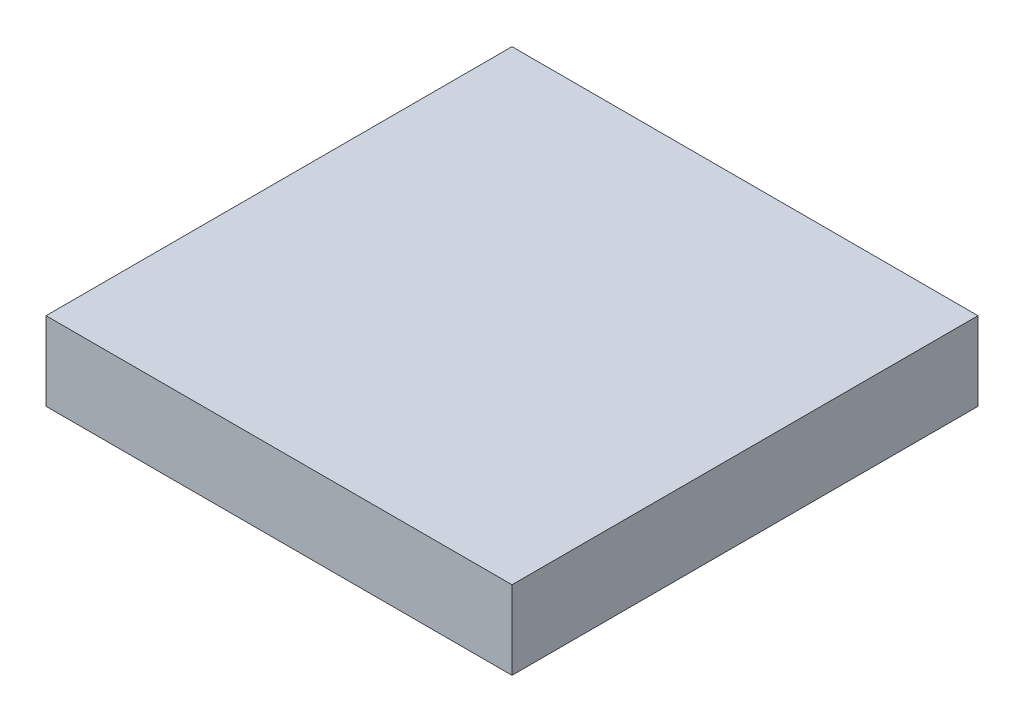
ISO-10303-21;
HEADER;
FILE_DESCRIPTION(('STEP AP214'),'2;1');
FILE_NAME('part.step','',(''),(''),'','','');
FILE_SCHEMA(('AUTOMOTIVE_DESIGN { 1 0 10303 214 1 1 1 1 }'));
ENDSEC;
DATA;
#1=APPLICATION_CONTEXT('core data for automotive mechanical design processes');
#2=APPLICATION_PROTOCOL_DEFINITION('international standard','automotive_design',2000,#1);
#3=PRODUCT_CONTEXT('',#1,'mechanical');
#4=PRODUCT('Part','Part','',(#3));
#5=PRODUCT_RELATED_PRODUCT_CATEGORY('part','',(#4));
#6=PRODUCT_DEFINITION_FORMATION('','',#4);
#7=PRODUCT_DEFINITION_CONTEXT('part definition',#1,'design');
#8=PRODUCT_DEFINITION('design','',#6,#7);
#9=PRODUCT_DEFINITION_SHAPE('','',#8);
#10=(LENGTH_UNIT() NAMED_UNIT(*) SI_UNIT(.MILLI.,.METRE.));
#11=(NAMED_UNIT(*) PLANE_ANGLE_UNIT() SI_UNIT($,.RADIAN.));
#12=(NAMED_UNIT(*) SI_UNIT($,.STERADIAN.) SOLID_ANGLE_UNIT());
#13=UNCERTAINTY_MEASURE_WITH_UNIT(LENGTH_MEASURE(1.E-05),#10,'distance_accuracy_value','');
#14=(GEOMETRIC_REPRESENTATION_CONTEXT(3) GLOBAL_UNCERTAINTY_ASSIGNED_CONTEXT((#13)) GLOBAL_UNIT_ASSIGNED_CONTEXT((#10,
#11,#12)) REPRESENTATION_CONTEXT('',''));
#15=CARTESIAN_POINT('',(0.,0.,0.));
#16=DIRECTION('',(0.,0.,1.));
#17=DIRECTION('',(1.,0.,0.));
#18=AXIS2_PLACEMENT_3D('',#15,#16,#17);
#19=CARTESIAN_POINT('',(86.0556847862956,99.4218000310896,7.34009304640791));
#20=DIRECTION('',(0.,0.,-1.));
#21=DIRECTION('',(-1.,0.,0.));
#22=AXIS2_PLACEMENT_3D('',#19,#20,#21);
#23=PLANE('',#22);
#24=DIRECTION('',(1.,0.,0.));
#25=VECTOR('',#24,1.);
#26=CARTESIAN_POINT('',(86.0556847862956,90.5892800165049,7.34009304640791));
#27=LINE('',#26,#25);
#28=CARTESIAN_POINT('',(86.0556847862956,90.5892800165049,7.34009304640791));
#29=VERTEX_POINT('',#28);
#30=CARTESIAN_POINT('',(138.498182619916,90.5892800165049,7.34009304640791));
#31=VERTEX_POINT('',#30);
#32=EDGE_CURVE('E79',#29,#31,#27,.T.);
#33=ORIENTED_EDGE('',*,*,#32,.F.);
#34=DIRECTION('',(0.,-1.,0.));
#35=VECTOR('',#34,1.);
#36=CARTESIAN_POINT('',(86.0556847862956,99.4218000310896,7.34009304640791));
#37=LINE('',#36,#35);
#38=CARTESIAN_POINT('',(86.0556847862956,99.4218000310896,7.34009304640791));
#39=VERTEX_POINT('',#38);
#40=EDGE_CURVE('E32',#39,#29,#37,.T.);
#41=ORIENTED_EDGE('',*,*,#40,.F.);
#42=DIRECTION('',(1.,0.,0.));
#43=VECTOR('',#42,1.);
#44=CARTESIAN_POINT('',(86.0556847862956,99.4218000310896,7.34009304640791));
#45=LINE('',#44,#43);
#46=CARTESIAN_POINT('',(138.498182619916,99.4218000310896,7.34009304640791));
#47=VERTEX_POINT('',#46);
#48=EDGE_CURVE('E71',#39,#47,#45,.T.);
#49=ORIENTED_EDGE('',*,*,#48,.T.);
#50=DIRECTION('',(0.,-1.,0.));
#51=VECTOR('',#50,1.);
#52=CARTESIAN_POINT('',(138.498182619916,99.4218000310896,7.34009304640791));
#53=LINE('',#52,#51);
#54=EDGE_CURVE('E10',#47,#31,#53,.T.);
#55=ORIENTED_EDGE('',*,*,#54,.T.);
#56=EDGE_LOOP('',(#33,#41,#49,#55));
#57=FACE_BOUND('',#56,.T.);
#58=ADVANCED_FACE('F16',(#57),#23,.T.);
#59=CARTESIAN_POINT('',(138.498182619916,99.4218000310896,7.34009304640791));
#60=DIRECTION('',(1.,0.,0.));
#61=DIRECTION('',(0.,0.,-1.));
#62=AXIS2_PLACEMENT_3D('',#59,#60,#61);
#63=PLANE('',#62);
#64=DIRECTION('',(0.,0.,1.));
#65=VECTOR('',#64,1.);
#66=CARTESIAN_POINT('',(138.498182619916,90.5892800165049,7.34009304640791));
#67=LINE('',#66,#65);
#68=CARTESIAN_POINT('',(138.498182619916,90.5892800165049,59.7825908800285));
#69=VERTEX_POINT('',#68);
#70=EDGE_CURVE('E82',#31,#69,#67,.T.);
#71=ORIENTED_EDGE('',*,*,#70,.F.);
#72=ORIENTED_EDGE('',*,*,#54,.F.);
#73=DIRECTION('',(0.,0.,1.));
#74=VECTOR('',#73,1.);
#75=CARTESIAN_POINT('',(138.498182619916,99.4218000310896,7.34009304640791));
#76=LINE('',#75,#74);
#77=CARTESIAN_POINT('',(138.498182619916,99.4218000310896,59.7825908800285));
#78=VERTEX_POINT('',#77);
#79=EDGE_CURVE('E67',#47,#78,#76,.T.);
#80=ORIENTED_EDGE('',*,*,#79,.T.);
#81=DIRECTION('',(0.,-1.,0.));
#82=VECTOR('',#81,1.);
#83=CARTESIAN_POINT('',(138.498182619916,99.4218000310896,59.7825908800285));
#84=LINE('',#83,#82);
#85=EDGE_CURVE('E24',#78,#69,#84,.T.);
#86=ORIENTED_EDGE('',*,*,#85,.T.);
#87=EDGE_LOOP('',(#71,#72,#80,#86));
#88=FACE_BOUND('',#87,.T.);
#89=ADVANCED_FACE('F68',(#88),#63,.T.);
#90=CARTESIAN_POINT('',(138.498182619916,99.4218000310896,59.7825908800285));
#91=DIRECTION('',(0.,0.,1.));
#92=DIRECTION('',(1.,0.,0.));
#93=AXIS2_PLACEMENT_3D('',#90,#91,#92);
#94=PLANE('',#93);
#95=DIRECTION('',(-1.,0.,0.));
#96=VECTOR('',#95,1.);
#97=CARTESIAN_POINT('',(138.498182619916,90.5892800165049,59.7825908800285));
#98=LINE('',#97,#96);
#99=CARTESIAN_POINT('',(86.0556847862956,90.5892800165049,59.7825908800285));
#100=VERTEX_POINT('',#99);
#101=EDGE_CURVE('E65',#69,#100,#98,.T.);
#102=ORIENTED_EDGE('',*,*,#101,.F.);
#103=ORIENTED_EDGE('',*,*,#85,.F.);
#104=DIRECTION('',(-1.,0.,0.));
#105=VECTOR('',#104,1.);
#106=CARTESIAN_POINT('',(138.498182619916,99.4218000310896,59.7825908800285));
#107=LINE('',#106,#105);
#108=CARTESIAN_POINT('',(86.0556847862956,99.4218000310896,59.7825908800285));
#109=VERTEX_POINT('',#108);
#110=EDGE_CURVE('E62',#78,#109,#107,.T.);
#111=ORIENTED_EDGE('',*,*,#110,.T.);
#112=DIRECTION('',(0.,-1.,0.));
#113=VECTOR('',#112,1.);
#114=CARTESIAN_POINT('',(86.0556847862956,99.4218000310896,59.7825908800285));
#115=LINE('',#114,#113);
#116=EDGE_CURVE('E48',#109,#100,#115,.T.);
#117=ORIENTED_EDGE('',*,*,#116,.T.);
#118=EDGE_LOOP('',(#102,#103,#111,#117));
#119=FACE_BOUND('',#118,.T.);
#120=ADVANCED_FACE('F60',(#119),#94,.T.);
#121=CARTESIAN_POINT('',(86.0556847862956,99.4218000310896,59.7825908800285));
#122=DIRECTION('',(-1.,0.,0.));
#123=DIRECTION('',(0.,0.,1.));
#124=AXIS2_PLACEMENT_3D('',#121,#122,#123);
#125=PLANE('',#124);
#126=DIRECTION('',(0.,0.,-1.));
#127=VECTOR('',#126,1.);
#128=CARTESIAN_POINT('',(86.0556847862956,90.5892800165049,59.7825908800285));
#129=LINE('',#128,#127);
#130=EDGE_CURVE('E85',#100,#29,#129,.T.);
#131=ORIENTED_EDGE('',*,*,#130,.F.);
#132=ORIENTED_EDGE('',*,*,#116,.F.);
#133=DIRECTION('',(0.,0.,-1.));
#134=VECTOR('',#133,1.);
#135=CARTESIAN_POINT('',(86.0556847862956,99.4218000310896,59.7825908800285));
#136=LINE('',#135,#134);
#137=EDGE_CURVE('E74',#109,#39,#136,.T.);
#138=ORIENTED_EDGE('',*,*,#137,.T.);
#139=ORIENTED_EDGE('',*,*,#40,.T.);
#140=EDGE_LOOP('',(#131,#132,#138,#139));
#141=FACE_BOUND('',#140,.T.);
#142=ADVANCED_FACE('F96',(#141),#125,.T.);
#143=CARTESIAN_POINT('',(224.776933703106,99.4218000310896,33.5613419632182));
#144=DIRECTION('',(0.,-1.,0.));
#145=DIRECTION('',(1.,0.,0.));
#146=AXIS2_PLACEMENT_3D('',#143,#144,#145);
#147=PLANE('',#146);
#148=ORIENTED_EDGE('',*,*,#48,.F.);
#149=ORIENTED_EDGE('',*,*,#137,.F.);
#150=ORIENTED_EDGE('',*,*,#110,.F.);
#151=ORIENTED_EDGE('',*,*,#79,.F.);
#152=EDGE_LOOP('',(#148,#149,#150,#151));
#153=FACE_BOUND('',#152,.T.);
#154=ADVANCED_FACE('F73',(#153),#147,.F.);
#155=CARTESIAN_POINT('',(224.776933703106,90.5892800165049,33.5613419632182));
#156=DIRECTION('',(0.,-1.,0.));
#157=DIRECTION('',(1.,0.,0.));
#158=AXIS2_PLACEMENT_3D('',#155,#156,#157);
#159=PLANE('',#158);
#160=ORIENTED_EDGE('',*,*,#32,.T.);
#161=ORIENTED_EDGE('',*,*,#70,.T.);
#162=ORIENTED_EDGE('',*,*,#101,.T.);
#163=ORIENTED_EDGE('',*,*,#130,.T.);
#164=EDGE_LOOP('',(#160,#161,#162,#163));
#165=FACE_BOUND('',#164,.T.);
#166=ADVANCED_FACE('F89',(#165),#159,.T.);
#167=CLOSED_SHELL('',(#58,#89,#120,#142,#154,#166));
#168=MANIFOLD_SOLID_BREP('B1',#167);
#169=ADVANCED_BREP_SHAPE_REPRESENTATION('',(#18,#168),#14);
#170=SHAPE_DEFINITION_REPRESENTATION(#9,#169);
ENDSEC;
END-ISO-10303-21;
